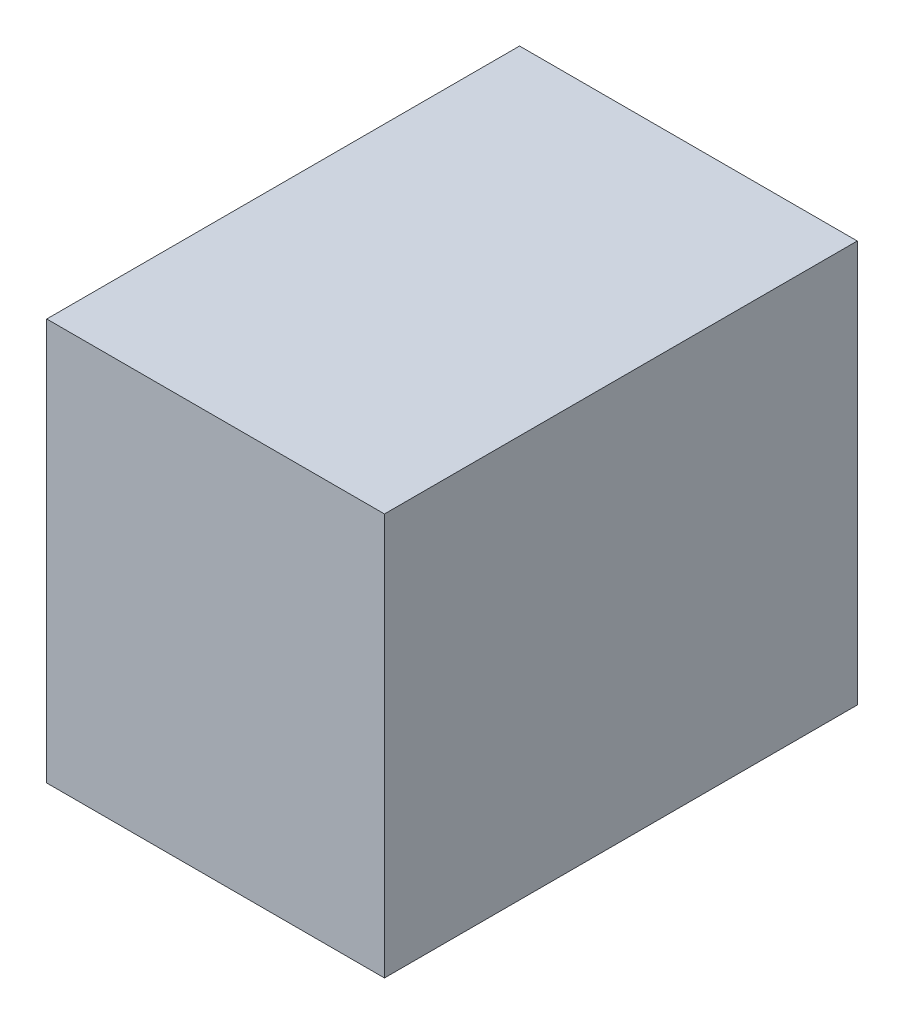
ISO-10303-21;
HEADER;
FILE_DESCRIPTION(('STEP AP214'),'2;1');
FILE_NAME('part.step','',(''),(''),'','','');
FILE_SCHEMA(('AUTOMOTIVE_DESIGN { 1 0 10303 214 1 1 1 1 }'));
ENDSEC;
DATA;
#1=APPLICATION_CONTEXT('core data for automotive mechanical design processes');
#2=APPLICATION_PROTOCOL_DEFINITION('international standard','automotive_design',2000,#1);
#3=PRODUCT_CONTEXT('',#1,'mechanical');
#4=PRODUCT('Part','Part','',(#3));
#5=PRODUCT_RELATED_PRODUCT_CATEGORY('part','',(#4));
#6=PRODUCT_DEFINITION_FORMATION('','',#4);
#7=PRODUCT_DEFINITION_CONTEXT('part definition',#1,'design');
#8=PRODUCT_DEFINITION('design','',#6,#7);
#9=PRODUCT_DEFINITION_SHAPE('','',#8);
#10=(LENGTH_UNIT() NAMED_UNIT(*) SI_UNIT(.MILLI.,.METRE.));
#11=(NAMED_UNIT(*) PLANE_ANGLE_UNIT() SI_UNIT($,.RADIAN.));
#12=(NAMED_UNIT(*) SI_UNIT($,.STERADIAN.) SOLID_ANGLE_UNIT());
#13=UNCERTAINTY_MEASURE_WITH_UNIT(LENGTH_MEASURE(1.E-05),#10,'distance_accuracy_value','');
#14=(GEOMETRIC_REPRESENTATION_CONTEXT(3) GLOBAL_UNCERTAINTY_ASSIGNED_CONTEXT((#13)) GLOBAL_UNIT_ASSIGNED_CONTEXT((#10,
#11,#12)) REPRESENTATION_CONTEXT('',''));
#15=CARTESIAN_POINT('',(0.,0.,0.));
#16=DIRECTION('',(0.,0.,1.));
#17=DIRECTION('',(1.,0.,0.));
#18=AXIS2_PLACEMENT_3D('',#15,#16,#17);
#19=CARTESIAN_POINT('',(0.,5.95,0.));
#20=DIRECTION('',(1.,0.,0.));
#21=DIRECTION('',(0.,0.,-1.));
#22=AXIS2_PLACEMENT_3D('',#19,#20,#21);
#23=PLANE('',#22);
#24=DIRECTION('',(0.,0.,1.));
#25=VECTOR('',#24,1.);
#26=CARTESIAN_POINT('',(0.,0.,0.));
#27=LINE('',#26,#25);
#28=CARTESIAN_POINT('',(0.,0.,-7.));
#29=VERTEX_POINT('',#28);
#30=CARTESIAN_POINT('',(0.,0.,0.));
#31=VERTEX_POINT('',#30);
#32=EDGE_CURVE('E98',#29,#31,#27,.T.);
#33=ORIENTED_EDGE('',*,*,#32,.T.);
#34=DIRECTION('',(0.,-1.,0.));
#35=VECTOR('',#34,1.);
#36=CARTESIAN_POINT('',(0.,5.95,0.));
#37=LINE('',#36,#35);
#38=CARTESIAN_POINT('',(0.,5.95,0.));
#39=VERTEX_POINT('',#38);
#40=EDGE_CURVE('E11',#39,#31,#37,.T.);
#41=ORIENTED_EDGE('',*,*,#40,.F.);
#42=DIRECTION('',(0.,0.,1.));
#43=VECTOR('',#42,1.);
#44=CARTESIAN_POINT('',(0.,5.95,0.));
#45=LINE('',#44,#43);
#46=CARTESIAN_POINT('',(0.,5.95,-7.));
#47=VERTEX_POINT('',#46);
#48=EDGE_CURVE('E86',#47,#39,#45,.T.);
#49=ORIENTED_EDGE('',*,*,#48,.F.);
#50=DIRECTION('',(0.,-1.,0.));
#51=VECTOR('',#50,1.);
#52=CARTESIAN_POINT('',(0.,5.95,-7.));
#53=LINE('',#52,#51);
#54=EDGE_CURVE('E94',#47,#29,#53,.T.);
#55=ORIENTED_EDGE('',*,*,#54,.T.);
#56=EDGE_LOOP('',(#33,#41,#49,#55));
#57=FACE_BOUND('',#56,.T.);
#58=ADVANCED_FACE('F35',(#57),#23,.F.);
#59=CARTESIAN_POINT('',(0.,5.95,0.));
#60=DIRECTION('',(0.,0.,-1.));
#61=DIRECTION('',(-1.,0.,0.));
#62=AXIS2_PLACEMENT_3D('',#59,#60,#61);
#63=PLANE('',#62);
#64=DIRECTION('',(1.,0.,0.));
#65=VECTOR('',#64,1.);
#66=CARTESIAN_POINT('',(0.,0.,0.));
#67=LINE('',#66,#65);
#68=CARTESIAN_POINT('',(5.,0.,0.));
#69=VERTEX_POINT('',#68);
#70=EDGE_CURVE('E90',#31,#69,#67,.T.);
#71=ORIENTED_EDGE('',*,*,#70,.T.);
#72=DIRECTION('',(0.,-1.,0.));
#73=VECTOR('',#72,1.);
#74=CARTESIAN_POINT('',(5.,5.95,0.));
#75=LINE('',#74,#73);
#76=CARTESIAN_POINT('',(5.,5.95,0.));
#77=VERTEX_POINT('',#76);
#78=EDGE_CURVE('E43',#77,#69,#75,.T.);
#79=ORIENTED_EDGE('',*,*,#78,.F.);
#80=DIRECTION('',(1.,0.,0.));
#81=VECTOR('',#80,1.);
#82=CARTESIAN_POINT('',(0.,5.95,0.));
#83=LINE('',#82,#81);
#84=EDGE_CURVE('E81',#39,#77,#83,.T.);
#85=ORIENTED_EDGE('',*,*,#84,.F.);
#86=ORIENTED_EDGE('',*,*,#40,.T.);
#87=EDGE_LOOP('',(#71,#79,#85,#86));
#88=FACE_BOUND('',#87,.T.);
#89=ADVANCED_FACE('F89',(#88),#63,.F.);
#90=CARTESIAN_POINT('',(5.,5.95,0.));
#91=DIRECTION('',(-1.,0.,0.));
#92=DIRECTION('',(0.,0.,1.));
#93=AXIS2_PLACEMENT_3D('',#90,#91,#92);
#94=PLANE('',#93);
#95=DIRECTION('',(0.,0.,-1.));
#96=VECTOR('',#95,1.);
#97=CARTESIAN_POINT('',(5.,0.,0.));
#98=LINE('',#97,#96);
#99=CARTESIAN_POINT('',(5.,0.,-7.));
#100=VERTEX_POINT('',#99);
#101=EDGE_CURVE('E68',#69,#100,#98,.T.);
#102=ORIENTED_EDGE('',*,*,#101,.T.);
#103=DIRECTION('',(0.,-1.,0.));
#104=VECTOR('',#103,1.);
#105=CARTESIAN_POINT('',(5.,5.95,-7.));
#106=LINE('',#105,#104);
#107=CARTESIAN_POINT('',(5.,5.95,-7.));
#108=VERTEX_POINT('',#107);
#109=EDGE_CURVE('E91',#108,#100,#106,.T.);
#110=ORIENTED_EDGE('',*,*,#109,.F.);
#111=DIRECTION('',(0.,0.,-1.));
#112=VECTOR('',#111,1.);
#113=CARTESIAN_POINT('',(5.,5.95,0.));
#114=LINE('',#113,#112);
#115=EDGE_CURVE('E84',#77,#108,#114,.T.);
#116=ORIENTED_EDGE('',*,*,#115,.F.);
#117=ORIENTED_EDGE('',*,*,#78,.T.);
#118=EDGE_LOOP('',(#102,#110,#116,#117));
#119=FACE_BOUND('',#118,.T.);
#120=ADVANCED_FACE('F92',(#119),#94,.F.);
#121=CARTESIAN_POINT('',(0.,5.95,-7.));
#122=DIRECTION('',(0.,0.,1.));
#123=DIRECTION('',(1.,0.,0.));
#124=AXIS2_PLACEMENT_3D('',#121,#122,#123);
#125=PLANE('',#124);
#126=DIRECTION('',(-1.,0.,0.));
#127=VECTOR('',#126,1.);
#128=CARTESIAN_POINT('',(0.,0.,-7.));
#129=LINE('',#128,#127);
#130=EDGE_CURVE('E74',#100,#29,#129,.T.);
#131=ORIENTED_EDGE('',*,*,#130,.T.);
#132=ORIENTED_EDGE('',*,*,#54,.F.);
#133=DIRECTION('',(-1.,0.,0.));
#134=VECTOR('',#133,1.);
#135=CARTESIAN_POINT('',(0.,5.95,-7.));
#136=LINE('',#135,#134);
#137=EDGE_CURVE('E51',#108,#47,#136,.T.);
#138=ORIENTED_EDGE('',*,*,#137,.F.);
#139=ORIENTED_EDGE('',*,*,#109,.T.);
#140=EDGE_LOOP('',(#131,#132,#138,#139));
#141=FACE_BOUND('',#140,.T.);
#142=ADVANCED_FACE('F105',(#141),#125,.F.);
#143=CARTESIAN_POINT('',(0.,5.95,0.));
#144=DIRECTION('',(0.,-1.,0.));
#145=DIRECTION('',(0.,0.,-1.));
#146=AXIS2_PLACEMENT_3D('',#143,#144,#145);
#147=PLANE('',#146);
#148=ORIENTED_EDGE('',*,*,#48,.T.);
#149=ORIENTED_EDGE('',*,*,#84,.T.);
#150=ORIENTED_EDGE('',*,*,#115,.T.);
#151=ORIENTED_EDGE('',*,*,#137,.T.);
#152=EDGE_LOOP('',(#148,#149,#150,#151));
#153=FACE_BOUND('',#152,.T.);
#154=ADVANCED_FACE('F82',(#153),#147,.F.);
#155=CARTESIAN_POINT('',(0.,0.,0.));
#156=DIRECTION('',(0.,-1.,0.));
#157=DIRECTION('',(0.,0.,-1.));
#158=AXIS2_PLACEMENT_3D('',#155,#156,#157);
#159=PLANE('',#158);
#160=ORIENTED_EDGE('',*,*,#32,.F.);
#161=ORIENTED_EDGE('',*,*,#130,.F.);
#162=ORIENTED_EDGE('',*,*,#101,.F.);
#163=ORIENTED_EDGE('',*,*,#70,.F.);
#164=EDGE_LOOP('',(#160,#161,#162,#163));
#165=FACE_BOUND('',#164,.T.);
#166=ADVANCED_FACE('F108',(#165),#159,.T.);
#167=CLOSED_SHELL('',(#58,#89,#120,#142,#154,#166));
#168=MANIFOLD_SOLID_BREP('B2',#167);
#169=ADVANCED_BREP_SHAPE_REPRESENTATION('',(#18,#168),#14);
#170=SHAPE_DEFINITION_REPRESENTATION(#9,#169);
ENDSEC;
END-ISO-10303-21;
